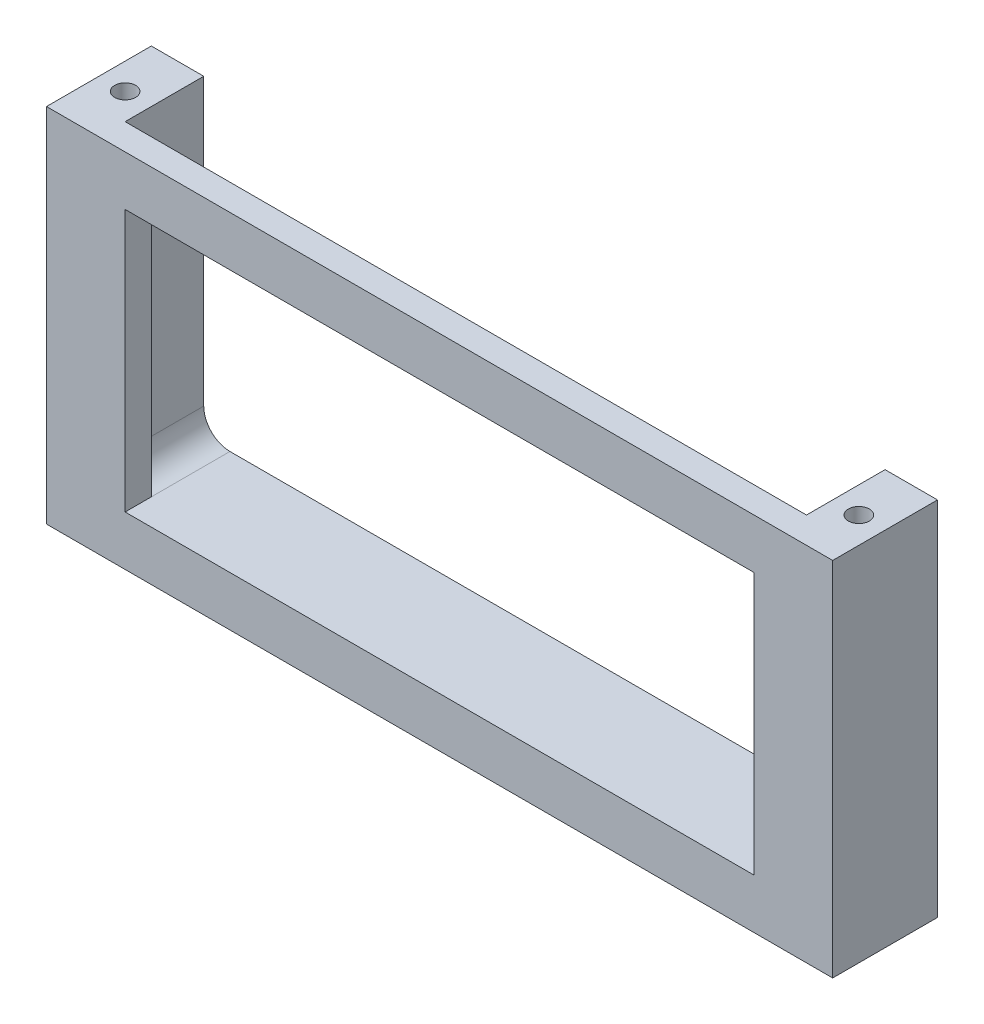
ISO-10303-21;
HEADER;
FILE_DESCRIPTION(('STEP AP214'),'2;1');
FILE_NAME('part.step','',(''),(''),'','','');
FILE_SCHEMA(('AUTOMOTIVE_DESIGN { 1 0 10303 214 1 1 1 1 }'));
ENDSEC;
DATA;
#1=APPLICATION_CONTEXT('core data for automotive mechanical design processes');
#2=APPLICATION_PROTOCOL_DEFINITION('international standard','automotive_design',2000,#1);
#3=PRODUCT_CONTEXT('',#1,'mechanical');
#4=PRODUCT('Part','Part','',(#3));
#5=PRODUCT_RELATED_PRODUCT_CATEGORY('part','',(#4));
#6=PRODUCT_DEFINITION_FORMATION('','',#4);
#7=PRODUCT_DEFINITION_CONTEXT('part definition',#1,'design');
#8=PRODUCT_DEFINITION('design','',#6,#7);
#9=PRODUCT_DEFINITION_SHAPE('','',#8);
#10=(LENGTH_UNIT() NAMED_UNIT(*) SI_UNIT(.MILLI.,.METRE.));
#11=(NAMED_UNIT(*) PLANE_ANGLE_UNIT() SI_UNIT($,.RADIAN.));
#12=(NAMED_UNIT(*) SI_UNIT($,.STERADIAN.) SOLID_ANGLE_UNIT());
#13=UNCERTAINTY_MEASURE_WITH_UNIT(LENGTH_MEASURE(1.E-05),#10,'distance_accuracy_value','');
#14=(GEOMETRIC_REPRESENTATION_CONTEXT(3) GLOBAL_UNCERTAINTY_ASSIGNED_CONTEXT((#13)) GLOBAL_UNIT_ASSIGNED_CONTEXT((#10,
#11,#12)) REPRESENTATION_CONTEXT('',''));
#15=CARTESIAN_POINT('',(0.,0.,0.));
#16=DIRECTION('',(0.,0.,1.));
#17=DIRECTION('',(1.,0.,0.));
#18=AXIS2_PLACEMENT_3D('',#15,#16,#17);
#19=CARTESIAN_POINT('',(64.9999999999999,69.,2.49999999999999));
#20=DIRECTION('',(0.,0.,-1.));
#21=DIRECTION('',(-1.,0.,0.));
#22=AXIS2_PLACEMENT_3D('',#19,#20,#21);
#23=PLANE('',#22);
#24=DIRECTION('',(0.,1.,0.));
#25=VECTOR('',#24,1.);
#26=CARTESIAN_POINT('',(-75.0000000000001,69.,2.50000000000001));
#27=LINE('',#26,#25);
#28=CARTESIAN_POINT('',(-75.0000000000001,0.,2.50000000000001));
#29=VERTEX_POINT('',#28);
#30=CARTESIAN_POINT('',(-75.0000000000001,69.,2.50000000000001));
#31=VERTEX_POINT('',#30);
#32=EDGE_CURVE('E140',#29,#31,#27,.T.);
#33=ORIENTED_EDGE('',*,*,#32,.F.);
#34=DIRECTION('',(1.,0.,0.));
#35=VECTOR('',#34,1.);
#36=CARTESIAN_POINT('',(64.9999999999999,0.,2.49999999999999));
#37=LINE('',#36,#35);
#38=CARTESIAN_POINT('',(75.,0.,2.49999999999999));
#39=VERTEX_POINT('',#38);
#40=EDGE_CURVE('E207',#29,#39,#37,.T.);
#41=ORIENTED_EDGE('',*,*,#40,.T.);
#42=DIRECTION('',(0.,-1.,0.));
#43=VECTOR('',#42,1.);
#44=CARTESIAN_POINT('',(75.,0.,2.49999999999999));
#45=LINE('',#44,#43);
#46=CARTESIAN_POINT('',(74.9999999999999,69.,2.49999999999999));
#47=VERTEX_POINT('',#46);
#48=EDGE_CURVE('E143',#47,#39,#45,.T.);
#49=ORIENTED_EDGE('',*,*,#48,.F.);
#50=DIRECTION('',(1.,0.,0.));
#51=VECTOR('',#50,1.);
#52=CARTESIAN_POINT('',(64.9999999999999,69.,2.49999999999999));
#53=LINE('',#52,#51);
#54=EDGE_CURVE('E214',#31,#47,#53,.T.);
#55=ORIENTED_EDGE('',*,*,#54,.F.);
#56=EDGE_LOOP('',(#33,#41,#49,#55));
#57=FACE_BOUND('',#56,.T.);
#58=DIRECTION('',(1.,0.,0.));
#59=VECTOR('',#58,1.);
#60=CARTESIAN_POINT('',(60.,9.50000000000001,2.5));
#61=LINE('',#60,#59);
#62=CARTESIAN_POINT('',(-60.,9.49999999999999,2.5));
#63=VERTEX_POINT('',#62);
#64=CARTESIAN_POINT('',(60.,9.50000000000001,2.5));
#65=VERTEX_POINT('',#64);
#66=EDGE_CURVE('E195',#63,#65,#61,.T.);
#67=ORIENTED_EDGE('',*,*,#66,.F.);
#68=DIRECTION('',(0.,-1.,0.));
#69=VECTOR('',#68,1.);
#70=CARTESIAN_POINT('',(-60.,59.5,2.5));
#71=LINE('',#70,#69);
#72=CARTESIAN_POINT('',(-60.,59.5,2.5));
#73=VERTEX_POINT('',#72);
#74=EDGE_CURVE('E185',#73,#63,#71,.T.);
#75=ORIENTED_EDGE('',*,*,#74,.F.);
#76=DIRECTION('',(-1.,0.,0.));
#77=VECTOR('',#76,1.);
#78=CARTESIAN_POINT('',(60.,59.5,2.5));
#79=LINE('',#78,#77);
#80=CARTESIAN_POINT('',(60.,59.5,2.5));
#81=VERTEX_POINT('',#80);
#82=EDGE_CURVE('E201',#81,#73,#79,.T.);
#83=ORIENTED_EDGE('',*,*,#82,.F.);
#84=DIRECTION('',(0.,1.,0.));
#85=VECTOR('',#84,1.);
#86=CARTESIAN_POINT('',(60.,59.5,2.5));
#87=LINE('',#86,#85);
#88=EDGE_CURVE('E198',#65,#81,#87,.T.);
#89=ORIENTED_EDGE('',*,*,#88,.F.);
#90=EDGE_LOOP('',(#67,#75,#83,#89));
#91=FACE_BOUND('',#90,.T.);
#92=ADVANCED_FACE('F36',(#57,#91),#23,.F.);
#93=CARTESIAN_POINT('',(64.9999999999999,69.,-2.50000000000001));
#94=DIRECTION('',(0.,0.,1.));
#95=DIRECTION('',(1.,0.,0.));
#96=AXIS2_PLACEMENT_3D('',#93,#94,#95);
#97=PLANE('',#96);
#98=DIRECTION('',(0.,-1.,0.));
#99=VECTOR('',#98,1.);
#100=CARTESIAN_POINT('',(64.9999999999999,69.,-2.50000000000001));
#101=LINE('',#100,#99);
#102=CARTESIAN_POINT('',(64.9999999999999,69.,-2.50000000000001));
#103=VERTEX_POINT('',#102);
#104=CARTESIAN_POINT('',(64.9999999999999,14.5,-2.50000000000001));
#105=VERTEX_POINT('',#104);
#106=EDGE_CURVE('E221',#103,#105,#101,.T.);
#107=ORIENTED_EDGE('',*,*,#106,.T.);
#108=CARTESIAN_POINT('',(60.,14.5,-2.50000000000001));
#109=DIRECTION('',(0.,0.,1.));
#110=DIRECTION('',(1.,0.,0.));
#111=AXIS2_PLACEMENT_3D('',#108,#109,#110);
#112=CIRCLE('',#111,5.);
#113=CARTESIAN_POINT('',(60.,9.49999999999999,-2.50000000000001));
#114=VERTEX_POINT('',#113);
#115=EDGE_CURVE('E240',#105,#114,#112,.F.);
#116=ORIENTED_EDGE('',*,*,#115,.T.);
#117=DIRECTION('',(0.,1.,0.));
#118=VECTOR('',#117,1.);
#119=CARTESIAN_POINT('',(60.,69.,-2.50000000000001));
#120=LINE('',#119,#118);
#121=CARTESIAN_POINT('',(60.,59.5,-2.50000000000001));
#122=VERTEX_POINT('',#121);
#123=EDGE_CURVE('E224',#114,#122,#120,.T.);
#124=ORIENTED_EDGE('',*,*,#123,.T.);
#125=DIRECTION('',(-1.,0.,0.));
#126=VECTOR('',#125,1.);
#127=CARTESIAN_POINT('',(64.9999999999999,59.5,-2.50000000000001));
#128=LINE('',#127,#126);
#129=CARTESIAN_POINT('',(-60.,59.5,-2.5));
#130=VERTEX_POINT('',#129);
#131=EDGE_CURVE('E227',#122,#130,#128,.T.);
#132=ORIENTED_EDGE('',*,*,#131,.T.);
#133=DIRECTION('',(0.,-1.,0.));
#134=VECTOR('',#133,1.);
#135=CARTESIAN_POINT('',(-60.,69.,-2.49999999999999));
#136=LINE('',#135,#134);
#137=CARTESIAN_POINT('',(-60.,9.49999999999999,-2.49999999999999));
#138=VERTEX_POINT('',#137);
#139=EDGE_CURVE('E230',#130,#138,#136,.T.);
#140=ORIENTED_EDGE('',*,*,#139,.T.);
#141=CARTESIAN_POINT('',(-60.,14.5,-2.49999999999999));
#142=DIRECTION('',(0.,0.,1.));
#143=DIRECTION('',(1.,0.,0.));
#144=AXIS2_PLACEMENT_3D('',#141,#142,#143);
#145=CIRCLE('',#144,5.);
#146=CARTESIAN_POINT('',(-65.0000000000001,14.5,-2.49999999999999));
#147=VERTEX_POINT('',#146);
#148=EDGE_CURVE('E57',#138,#147,#145,.F.);
#149=ORIENTED_EDGE('',*,*,#148,.T.);
#150=DIRECTION('',(0.,-1.,0.));
#151=VECTOR('',#150,1.);
#152=CARTESIAN_POINT('',(-65.0000000000001,69.,-2.49999999999999));
#153=LINE('',#152,#151);
#154=CARTESIAN_POINT('',(-65.0000000000001,69.,-2.50000000000001));
#155=VERTEX_POINT('',#154);
#156=EDGE_CURVE('E218',#155,#147,#153,.T.);
#157=ORIENTED_EDGE('',*,*,#156,.F.);
#158=DIRECTION('',(-1.,0.,0.));
#159=VECTOR('',#158,1.);
#160=CARTESIAN_POINT('',(64.9999999999999,69.,-2.50000000000001));
#161=LINE('',#160,#159);
#162=EDGE_CURVE('E216',#103,#155,#161,.T.);
#163=ORIENTED_EDGE('',*,*,#162,.F.);
#164=EDGE_LOOP('',(#107,#116,#124,#132,#140,#149,#157,#163));
#165=FACE_BOUND('',#164,.T.);
#166=ADVANCED_FACE('F255',(#165),#97,.F.);
#167=CARTESIAN_POINT('',(0.,69.,0.));
#168=DIRECTION('',(0.,-1.,0.));
#169=DIRECTION('',(0.,0.,-1.));
#170=AXIS2_PLACEMENT_3D('',#167,#168,#169);
#171=PLANE('',#170);
#172=CARTESIAN_POINT('',(-70.0000000000001,69.,-7.50000000000001));
#173=DIRECTION('',(0.,1.,0.));
#174=DIRECTION('',(0.,0.,1.));
#175=AXIS2_PLACEMENT_3D('',#172,#173,#174);
#176=CIRCLE('',#175,2.);
#177=CARTESIAN_POINT('',(-70.0000000000001,69.,-5.50000000000001));
#178=VERTEX_POINT('',#177);
#179=EDGE_CURVE('E162',#178,#178,#176,.T.);
#180=ORIENTED_EDGE('',*,*,#179,.F.);
#181=EDGE_LOOP('',(#180));
#182=FACE_BOUND('',#181,.T.);
#183=CARTESIAN_POINT('',(70.0000000000001,69.,-7.50000000000001));
#184=DIRECTION('',(0.,1.,0.));
#185=DIRECTION('',(0.,0.,-1.));
#186=AXIS2_PLACEMENT_3D('',#183,#184,#185);
#187=CIRCLE('',#186,2.);
#188=CARTESIAN_POINT('',(70.0000000000001,69.,-9.50000000000001));
#189=VERTEX_POINT('',#188);
#190=EDGE_CURVE('E165',#189,#189,#187,.T.);
#191=ORIENTED_EDGE('',*,*,#190,.F.);
#192=EDGE_LOOP('',(#191));
#193=FACE_BOUND('',#192,.T.);
#194=ORIENTED_EDGE('',*,*,#162,.T.);
#195=DIRECTION('',(0.,0.,-1.));
#196=VECTOR('',#195,1.);
#197=CARTESIAN_POINT('',(-65.0000000000001,69.,2.50000000000001));
#198=LINE('',#197,#196);
#199=CARTESIAN_POINT('',(-65.0000000000001,69.,-17.5));
#200=VERTEX_POINT('',#199);
#201=EDGE_CURVE('E142',#155,#200,#198,.T.);
#202=ORIENTED_EDGE('',*,*,#201,.T.);
#203=DIRECTION('',(1.,0.,0.));
#204=VECTOR('',#203,1.);
#205=CARTESIAN_POINT('',(-65.0000000000001,69.,-17.5));
#206=LINE('',#205,#204);
#207=CARTESIAN_POINT('',(-75.0000000000001,69.,-17.5));
#208=VERTEX_POINT('',#207);
#209=EDGE_CURVE('E146',#208,#200,#206,.T.);
#210=ORIENTED_EDGE('',*,*,#209,.F.);
#211=DIRECTION('',(0.,0.,-1.));
#212=VECTOR('',#211,1.);
#213=CARTESIAN_POINT('',(-75.0000000000001,69.,2.50000000000001));
#214=LINE('',#213,#212);
#215=EDGE_CURVE('E133',#31,#208,#214,.T.);
#216=ORIENTED_EDGE('',*,*,#215,.F.);
#217=ORIENTED_EDGE('',*,*,#54,.T.);
#218=DIRECTION('',(0.,0.,-1.));
#219=VECTOR('',#218,1.);
#220=CARTESIAN_POINT('',(74.9999999999999,69.,2.49999999999999));
#221=LINE('',#220,#219);
#222=CARTESIAN_POINT('',(74.9999999999999,69.,-17.5));
#223=VERTEX_POINT('',#222);
#224=EDGE_CURVE('E188',#47,#223,#221,.T.);
#225=ORIENTED_EDGE('',*,*,#224,.T.);
#226=DIRECTION('',(1.,0.,0.));
#227=VECTOR('',#226,1.);
#228=CARTESIAN_POINT('',(74.9999999999999,69.,-17.5));
#229=LINE('',#228,#227);
#230=CARTESIAN_POINT('',(64.9999999999999,69.,-17.5));
#231=VERTEX_POINT('',#230);
#232=EDGE_CURVE('E174',#231,#223,#229,.T.);
#233=ORIENTED_EDGE('',*,*,#232,.F.);
#234=DIRECTION('',(0.,0.,-1.));
#235=VECTOR('',#234,1.);
#236=CARTESIAN_POINT('',(64.9999999999999,69.,2.49999999999999));
#237=LINE('',#236,#235);
#238=EDGE_CURVE('E190',#103,#231,#237,.T.);
#239=ORIENTED_EDGE('',*,*,#238,.F.);
#240=EDGE_LOOP('',(#194,#202,#210,#216,#217,#225,#233,#239));
#241=FACE_BOUND('',#240,.T.);
#242=ADVANCED_FACE('F148',(#182,#193,#241),#171,.F.);
#243=CARTESIAN_POINT('',(0.,0.,0.));
#244=DIRECTION('',(0.,-1.,0.));
#245=DIRECTION('',(0.,0.,-1.));
#246=AXIS2_PLACEMENT_3D('',#243,#244,#245);
#247=PLANE('',#246);
#248=CARTESIAN_POINT('',(-70.0000000000001,0.,-7.50000000000001));
#249=DIRECTION('',(0.,1.,0.));
#250=DIRECTION('',(0.,0.,1.));
#251=AXIS2_PLACEMENT_3D('',#248,#249,#250);
#252=CIRCLE('',#251,2.);
#253=CARTESIAN_POINT('',(-70.0000000000001,0.,-5.50000000000001));
#254=VERTEX_POINT('',#253);
#255=EDGE_CURVE('E159',#254,#254,#252,.T.);
#256=ORIENTED_EDGE('',*,*,#255,.T.);
#257=EDGE_LOOP('',(#256));
#258=FACE_BOUND('',#257,.T.);
#259=CARTESIAN_POINT('',(70.0000000000001,0.,-7.50000000000001));
#260=DIRECTION('',(0.,1.,0.));
#261=DIRECTION('',(0.,0.,-1.));
#262=AXIS2_PLACEMENT_3D('',#259,#260,#261);
#263=CIRCLE('',#262,2.);
#264=CARTESIAN_POINT('',(70.0000000000001,0.,-9.50000000000001));
#265=VERTEX_POINT('',#264);
#266=EDGE_CURVE('E332',#265,#265,#263,.T.);
#267=ORIENTED_EDGE('',*,*,#266,.T.);
#268=EDGE_LOOP('',(#267));
#269=FACE_BOUND('',#268,.T.);
#270=ORIENTED_EDGE('',*,*,#40,.F.);
#271=DIRECTION('',(0.,0.,-1.));
#272=VECTOR('',#271,1.);
#273=CARTESIAN_POINT('',(-75.0000000000001,0.,2.50000000000001));
#274=LINE('',#273,#272);
#275=CARTESIAN_POINT('',(-75.0000000000001,0.,-17.5));
#276=VERTEX_POINT('',#275);
#277=EDGE_CURVE('E183',#29,#276,#274,.T.);
#278=ORIENTED_EDGE('',*,*,#277,.T.);
#279=DIRECTION('',(-1.,0.,0.));
#280=VECTOR('',#279,1.);
#281=CARTESIAN_POINT('',(-75.0000000000001,0.,-17.5));
#282=LINE('',#281,#280);
#283=CARTESIAN_POINT('',(75.,0.,-17.5));
#284=VERTEX_POINT('',#283);
#285=EDGE_CURVE('E158',#284,#276,#282,.T.);
#286=ORIENTED_EDGE('',*,*,#285,.F.);
#287=DIRECTION('',(0.,0.,-1.));
#288=VECTOR('',#287,1.);
#289=CARTESIAN_POINT('',(75.,0.,2.49999999999999));
#290=LINE('',#289,#288);
#291=EDGE_CURVE('E186',#39,#284,#290,.T.);
#292=ORIENTED_EDGE('',*,*,#291,.F.);
#293=EDGE_LOOP('',(#270,#278,#286,#292));
#294=FACE_BOUND('',#293,.T.);
#295=ADVANCED_FACE('F321',(#258,#269,#294),#247,.T.);
#296=CARTESIAN_POINT('',(-60.,59.5,-62.5));
#297=DIRECTION('',(-1.,0.,0.));
#298=DIRECTION('',(0.,-1.,0.));
#299=AXIS2_PLACEMENT_3D('',#296,#297,#298);
#300=PLANE('',#299);
#301=DIRECTION('',(0.,0.,1.));
#302=VECTOR('',#301,1.);
#303=CARTESIAN_POINT('',(-60.,59.5,-62.5));
#304=LINE('',#303,#302);
#305=EDGE_CURVE('E205',#130,#73,#304,.T.);
#306=ORIENTED_EDGE('',*,*,#305,.T.);
#307=ORIENTED_EDGE('',*,*,#74,.T.);
#308=DIRECTION('',(0.,0.,1.));
#309=VECTOR('',#308,1.);
#310=CARTESIAN_POINT('',(-60.,9.49999999999999,-62.5));
#311=LINE('',#310,#309);
#312=EDGE_CURVE('E204',#138,#63,#311,.T.);
#313=ORIENTED_EDGE('',*,*,#312,.F.);
#314=ORIENTED_EDGE('',*,*,#139,.F.);
#315=EDGE_LOOP('',(#306,#307,#313,#314));
#316=FACE_BOUND('',#315,.T.);
#317=ADVANCED_FACE('F274',(#316),#300,.F.);
#318=CARTESIAN_POINT('',(60.,59.5,-62.5));
#319=DIRECTION('',(0.,1.,0.));
#320=DIRECTION('',(-1.,0.,0.));
#321=AXIS2_PLACEMENT_3D('',#318,#319,#320);
#322=PLANE('',#321);
#323=DIRECTION('',(0.,0.,1.));
#324=VECTOR('',#323,1.);
#325=CARTESIAN_POINT('',(60.,59.5,-62.5));
#326=LINE('',#325,#324);
#327=EDGE_CURVE('E208',#122,#81,#326,.T.);
#328=ORIENTED_EDGE('',*,*,#327,.T.);
#329=ORIENTED_EDGE('',*,*,#82,.T.);
#330=ORIENTED_EDGE('',*,*,#305,.F.);
#331=ORIENTED_EDGE('',*,*,#131,.F.);
#332=EDGE_LOOP('',(#328,#329,#330,#331));
#333=FACE_BOUND('',#332,.T.);
#334=ADVANCED_FACE('F267',(#333),#322,.F.);
#335=CARTESIAN_POINT('',(60.,59.5,-62.5));
#336=DIRECTION('',(1.,0.,0.));
#337=DIRECTION('',(0.,1.,0.));
#338=AXIS2_PLACEMENT_3D('',#335,#336,#337);
#339=PLANE('',#338);
#340=DIRECTION('',(0.,0.,1.));
#341=VECTOR('',#340,1.);
#342=CARTESIAN_POINT('',(60.,9.50000000000001,-62.5));
#343=LINE('',#342,#341);
#344=EDGE_CURVE('E210',#114,#65,#343,.T.);
#345=ORIENTED_EDGE('',*,*,#344,.T.);
#346=ORIENTED_EDGE('',*,*,#88,.T.);
#347=ORIENTED_EDGE('',*,*,#327,.F.);
#348=ORIENTED_EDGE('',*,*,#123,.F.);
#349=EDGE_LOOP('',(#345,#346,#347,#348));
#350=FACE_BOUND('',#349,.T.);
#351=ADVANCED_FACE('F264',(#350),#339,.F.);
#352=CARTESIAN_POINT('',(60.,9.50000000000001,-62.5));
#353=DIRECTION('',(0.,-1.,0.));
#354=DIRECTION('',(1.,0.,0.));
#355=AXIS2_PLACEMENT_3D('',#352,#353,#354);
#356=PLANE('',#355);
#357=ORIENTED_EDGE('',*,*,#344,.F.);
#358=DIRECTION('',(0.,0.,-1.));
#359=VECTOR('',#358,1.);
#360=CARTESIAN_POINT('',(60.,9.50000000000001,-62.5));
#361=LINE('',#360,#359);
#362=CARTESIAN_POINT('',(60.,9.49999999999999,-17.5));
#363=VERTEX_POINT('',#362);
#364=EDGE_CURVE('E234',#114,#363,#361,.T.);
#365=ORIENTED_EDGE('',*,*,#364,.T.);
#366=DIRECTION('',(1.,0.,0.));
#367=VECTOR('',#366,1.);
#368=CARTESIAN_POINT('',(64.9999999999999,9.49999999999999,-17.5));
#369=LINE('',#368,#367);
#370=CARTESIAN_POINT('',(-60.,9.49999999999999,-17.5));
#371=VERTEX_POINT('',#370);
#372=EDGE_CURVE('E169',#371,#363,#369,.T.);
#373=ORIENTED_EDGE('',*,*,#372,.F.);
#374=DIRECTION('',(0.,0.,-1.));
#375=VECTOR('',#374,1.);
#376=CARTESIAN_POINT('',(-60.0000000000001,9.49999999999999,-62.5));
#377=LINE('',#376,#375);
#378=EDGE_CURVE('E232',#371,#138,#377,.F.);
#379=ORIENTED_EDGE('',*,*,#378,.T.);
#380=ORIENTED_EDGE('',*,*,#312,.T.);
#381=ORIENTED_EDGE('',*,*,#66,.T.);
#382=EDGE_LOOP('',(#357,#365,#373,#379,#380,#381));
#383=FACE_BOUND('',#382,.T.);
#384=ADVANCED_FACE('F259',(#383),#356,.F.);
#385=CARTESIAN_POINT('',(64.9999999999999,69.,2.49999999999999));
#386=DIRECTION('',(-1.,0.,0.));
#387=DIRECTION('',(0.,-1.,0.));
#388=AXIS2_PLACEMENT_3D('',#385,#386,#387);
#389=PLANE('',#388);
#390=DIRECTION('',(0.,1.,0.));
#391=VECTOR('',#390,1.);
#392=CARTESIAN_POINT('',(64.9999999999999,69.,-17.5));
#393=LINE('',#392,#391);
#394=CARTESIAN_POINT('',(64.9999999999999,14.5,-17.5));
#395=VERTEX_POINT('',#394);
#396=EDGE_CURVE('E172',#395,#231,#393,.T.);
#397=ORIENTED_EDGE('',*,*,#396,.F.);
#398=DIRECTION('',(0.,0.,-1.));
#399=VECTOR('',#398,1.);
#400=CARTESIAN_POINT('',(64.9999999999999,14.5,2.49999999999999));
#401=LINE('',#400,#399);
#402=EDGE_CURVE('E237',#395,#105,#401,.F.);
#403=ORIENTED_EDGE('',*,*,#402,.T.);
#404=ORIENTED_EDGE('',*,*,#106,.F.);
#405=ORIENTED_EDGE('',*,*,#238,.T.);
#406=EDGE_LOOP('',(#397,#403,#404,#405));
#407=FACE_BOUND('',#406,.T.);
#408=ADVANCED_FACE('F249',(#407),#389,.T.);
#409=CARTESIAN_POINT('',(-65.,9.49999999999999,2.50000000000001));
#410=DIRECTION('',(1.,0.,0.));
#411=DIRECTION('',(0.,1.,0.));
#412=AXIS2_PLACEMENT_3D('',#409,#410,#411);
#413=PLANE('',#412);
#414=ORIENTED_EDGE('',*,*,#156,.T.);
#415=DIRECTION('',(0.,0.,-1.));
#416=VECTOR('',#415,1.);
#417=CARTESIAN_POINT('',(-65.,14.5,2.50000000000001));
#418=LINE('',#417,#416);
#419=CARTESIAN_POINT('',(-65.,14.5,-17.5));
#420=VERTEX_POINT('',#419);
#421=EDGE_CURVE('E242',#147,#420,#418,.T.);
#422=ORIENTED_EDGE('',*,*,#421,.T.);
#423=DIRECTION('',(0.,-1.,0.));
#424=VECTOR('',#423,1.);
#425=CARTESIAN_POINT('',(-65.,9.49999999999999,-17.5));
#426=LINE('',#425,#424);
#427=EDGE_CURVE('E152',#200,#420,#426,.T.);
#428=ORIENTED_EDGE('',*,*,#427,.F.);
#429=ORIENTED_EDGE('',*,*,#201,.F.);
#430=EDGE_LOOP('',(#414,#422,#428,#429));
#431=FACE_BOUND('',#430,.T.);
#432=ADVANCED_FACE('F273',(#431),#413,.T.);
#433=CARTESIAN_POINT('',(-75.0000000000001,69.,2.50000000000001));
#434=DIRECTION('',(-1.,0.,0.));
#435=DIRECTION('',(0.,-1.,0.));
#436=AXIS2_PLACEMENT_3D('',#433,#434,#435);
#437=PLANE('',#436);
#438=ORIENTED_EDGE('',*,*,#215,.T.);
#439=DIRECTION('',(0.,1.,0.));
#440=VECTOR('',#439,1.);
#441=CARTESIAN_POINT('',(-75.0000000000001,69.,-17.5));
#442=LINE('',#441,#440);
#443=EDGE_CURVE('E138',#276,#208,#442,.T.);
#444=ORIENTED_EDGE('',*,*,#443,.F.);
#445=ORIENTED_EDGE('',*,*,#277,.F.);
#446=ORIENTED_EDGE('',*,*,#32,.T.);
#447=EDGE_LOOP('',(#438,#444,#445,#446));
#448=FACE_BOUND('',#447,.T.);
#449=ADVANCED_FACE('F135',(#448),#437,.T.);
#450=CARTESIAN_POINT('',(75.,0.,2.49999999999999));
#451=DIRECTION('',(1.,0.,0.));
#452=DIRECTION('',(0.,1.,0.));
#453=AXIS2_PLACEMENT_3D('',#450,#451,#452);
#454=PLANE('',#453);
#455=ORIENTED_EDGE('',*,*,#291,.T.);
#456=DIRECTION('',(0.,-1.,0.));
#457=VECTOR('',#456,1.);
#458=CARTESIAN_POINT('',(75.,0.,-17.5));
#459=LINE('',#458,#457);
#460=EDGE_CURVE('E177',#223,#284,#459,.T.);
#461=ORIENTED_EDGE('',*,*,#460,.F.);
#462=ORIENTED_EDGE('',*,*,#224,.F.);
#463=ORIENTED_EDGE('',*,*,#48,.T.);
#464=EDGE_LOOP('',(#455,#461,#462,#463));
#465=FACE_BOUND('',#464,.T.);
#466=ADVANCED_FACE('F303',(#465),#454,.T.);
#467=CARTESIAN_POINT('',(0.,0.,-17.5));
#468=DIRECTION('',(0.,0.,1.));
#469=DIRECTION('',(1.,0.,0.));
#470=AXIS2_PLACEMENT_3D('',#467,#468,#469);
#471=PLANE('',#470);
#472=ORIENTED_EDGE('',*,*,#443,.T.);
#473=ORIENTED_EDGE('',*,*,#209,.T.);
#474=ORIENTED_EDGE('',*,*,#427,.T.);
#475=CARTESIAN_POINT('',(-60.,14.5,-17.5));
#476=DIRECTION('',(0.,0.,1.));
#477=DIRECTION('',(1.,0.,0.));
#478=AXIS2_PLACEMENT_3D('',#475,#476,#477);
#479=CIRCLE('',#478,5.);
#480=EDGE_CURVE('E11',#420,#371,#479,.T.);
#481=ORIENTED_EDGE('',*,*,#480,.T.);
#482=ORIENTED_EDGE('',*,*,#372,.T.);
#483=CARTESIAN_POINT('',(60.,14.5,-17.5));
#484=DIRECTION('',(0.,0.,1.));
#485=DIRECTION('',(1.,0.,0.));
#486=AXIS2_PLACEMENT_3D('',#483,#484,#485);
#487=CIRCLE('',#486,5.);
#488=EDGE_CURVE('E44',#363,#395,#487,.T.);
#489=ORIENTED_EDGE('',*,*,#488,.T.);
#490=ORIENTED_EDGE('',*,*,#396,.T.);
#491=ORIENTED_EDGE('',*,*,#232,.T.);
#492=ORIENTED_EDGE('',*,*,#460,.T.);
#493=ORIENTED_EDGE('',*,*,#285,.T.);
#494=EDGE_LOOP('',(#472,#473,#474,#481,#482,#489,#490,#491,#492,#493));
#495=FACE_BOUND('',#494,.T.);
#496=ADVANCED_FACE('F155',(#495),#471,.F.);
#497=CARTESIAN_POINT('',(70.0000000000001,0.,-7.50000000000001));
#498=DIRECTION('',(0.,1.,0.));
#499=DIRECTION('',(0.,0.,1.));
#500=AXIS2_PLACEMENT_3D('',#497,#498,#499);
#501=CYLINDRICAL_SURFACE('',#500,2.);
#502=ORIENTED_EDGE('',*,*,#266,.F.);
#503=EDGE_LOOP('',(#502));
#504=FACE_BOUND('',#503,.T.);
#505=ORIENTED_EDGE('',*,*,#190,.T.);
#506=EDGE_LOOP('',(#505));
#507=FACE_BOUND('',#506,.T.);
#508=ADVANCED_FACE('F290',(#504,#507),#501,.F.);
#509=CARTESIAN_POINT('',(-70.0000000000001,0.,-7.50000000000001));
#510=DIRECTION('',(0.,1.,0.));
#511=DIRECTION('',(0.,0.,1.));
#512=AXIS2_PLACEMENT_3D('',#509,#510,#511);
#513=CYLINDRICAL_SURFACE('',#512,2.);
#514=ORIENTED_EDGE('',*,*,#255,.F.);
#515=EDGE_LOOP('',(#514));
#516=FACE_BOUND('',#515,.T.);
#517=ORIENTED_EDGE('',*,*,#179,.T.);
#518=EDGE_LOOP('',(#517));
#519=FACE_BOUND('',#518,.T.);
#520=ADVANCED_FACE('F285',(#516,#519),#513,.F.);
#521=CARTESIAN_POINT('',(60.,14.5,-62.5));
#522=DIRECTION('',(0.,0.,-1.));
#523=DIRECTION('',(-1.,0.,0.));
#524=AXIS2_PLACEMENT_3D('',#521,#522,#523);
#525=CYLINDRICAL_SURFACE('',#524,5.);
#526=ORIENTED_EDGE('',*,*,#115,.F.);
#527=ORIENTED_EDGE('',*,*,#402,.F.);
#528=ORIENTED_EDGE('',*,*,#488,.F.);
#529=ORIENTED_EDGE('',*,*,#364,.F.);
#530=EDGE_LOOP('',(#526,#527,#528,#529));
#531=FACE_BOUND('',#530,.T.);
#532=ADVANCED_FACE('F253',(#531),#525,.F.);
#533=CARTESIAN_POINT('',(-60.,14.5,2.50000000000001));
#534=DIRECTION('',(0.,0.,-1.));
#535=DIRECTION('',(-1.,0.,0.));
#536=AXIS2_PLACEMENT_3D('',#533,#534,#535);
#537=CYLINDRICAL_SURFACE('',#536,5.);
#538=ORIENTED_EDGE('',*,*,#148,.F.);
#539=ORIENTED_EDGE('',*,*,#378,.F.);
#540=ORIENTED_EDGE('',*,*,#480,.F.);
#541=ORIENTED_EDGE('',*,*,#421,.F.);
#542=EDGE_LOOP('',(#538,#539,#540,#541));
#543=FACE_BOUND('',#542,.T.);
#544=ADVANCED_FACE('F38',(#543),#537,.F.);
#545=CLOSED_SHELL('',(#92,#166,#242,#295,#317,#334,#351,#384,#408,#432,#449,#466,#496,#508,#520,
#532,#544));
#546=MANIFOLD_SOLID_BREP('B2',#545);
#547=ADVANCED_BREP_SHAPE_REPRESENTATION('',(#18,#546),#14);
#548=SHAPE_DEFINITION_REPRESENTATION(#9,#547);
ENDSEC;
END-ISO-10303-21;
